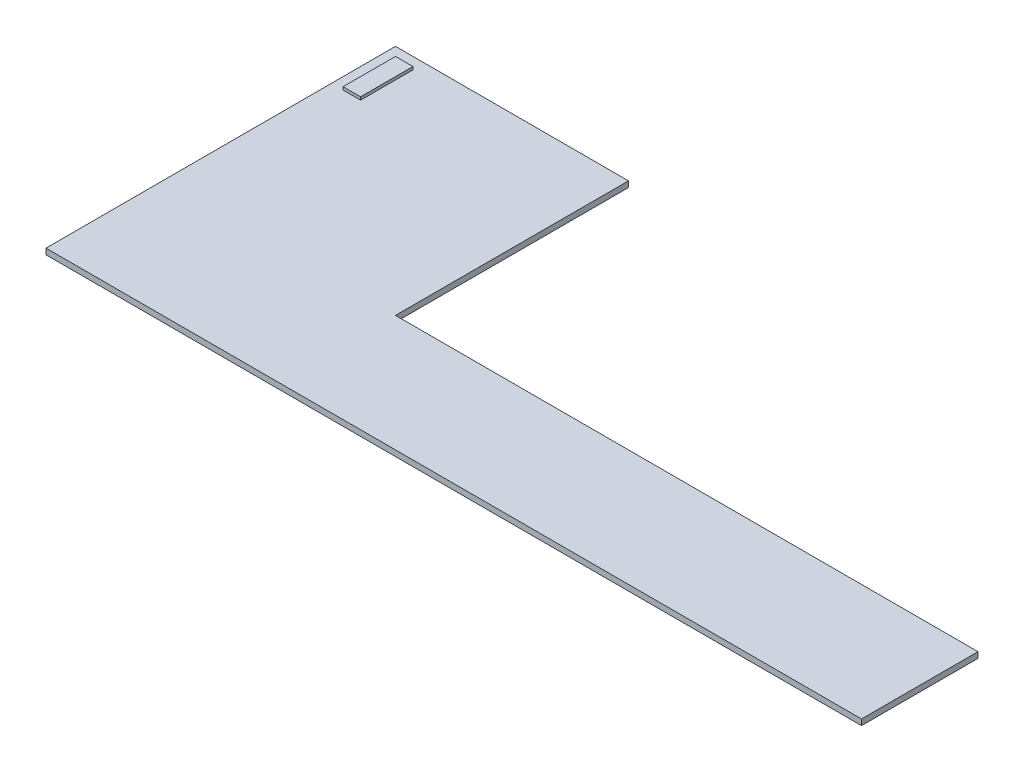
ISO-10303-21;
HEADER;
FILE_DESCRIPTION(('STEP AP214'),'2;1');
FILE_NAME('part.step','',(''),(''),'','','');
FILE_SCHEMA(('AUTOMOTIVE_DESIGN { 1 0 10303 214 1 1 1 1 }'));
ENDSEC;
DATA;
#1=APPLICATION_CONTEXT('core data for automotive mechanical design processes');
#2=APPLICATION_PROTOCOL_DEFINITION('international standard','automotive_design',2000,#1);
#3=PRODUCT_CONTEXT('',#1,'mechanical');
#4=PRODUCT('Part','Part','',(#3));
#5=PRODUCT_RELATED_PRODUCT_CATEGORY('part','',(#4));
#6=PRODUCT_DEFINITION_FORMATION('','',#4);
#7=PRODUCT_DEFINITION_CONTEXT('part definition',#1,'design');
#8=PRODUCT_DEFINITION('design','',#6,#7);
#9=PRODUCT_DEFINITION_SHAPE('','',#8);
#10=(LENGTH_UNIT() NAMED_UNIT(*) SI_UNIT(.MILLI.,.METRE.));
#11=(NAMED_UNIT(*) PLANE_ANGLE_UNIT() SI_UNIT($,.RADIAN.));
#12=(NAMED_UNIT(*) SI_UNIT($,.STERADIAN.) SOLID_ANGLE_UNIT());
#13=UNCERTAINTY_MEASURE_WITH_UNIT(LENGTH_MEASURE(1.E-05),#10,'distance_accuracy_value','');
#14=(GEOMETRIC_REPRESENTATION_CONTEXT(3) GLOBAL_UNCERTAINTY_ASSIGNED_CONTEXT((#13)) GLOBAL_UNIT_ASSIGNED_CONTEXT((#10,
#11,#12)) REPRESENTATION_CONTEXT('',''));
#15=CARTESIAN_POINT('',(0.,0.,0.));
#16=DIRECTION('',(0.,0.,1.));
#17=DIRECTION('',(1.,0.,0.));
#18=AXIS2_PLACEMENT_3D('',#15,#16,#17);
#19=CARTESIAN_POINT('',(0.,2.54,0.));
#20=DIRECTION('',(0.,0.,1.));
#21=DIRECTION('',(1.,0.,0.));
#22=AXIS2_PLACEMENT_3D('',#19,#20,#21);
#23=PLANE('',#22);
#24=DIRECTION('',(-1.,0.,0.));
#25=VECTOR('',#24,1.);
#26=CARTESIAN_POINT('',(0.,0.,0.));
#27=LINE('',#26,#25);
#28=CARTESIAN_POINT('',(254.,0.,0.));
#29=VERTEX_POINT('',#28);
#30=CARTESIAN_POINT('',(0.,0.,0.));
#31=VERTEX_POINT('',#30);
#32=EDGE_CURVE('E118',#29,#31,#27,.T.);
#33=ORIENTED_EDGE('',*,*,#32,.T.);
#34=DIRECTION('',(0.,-1.,0.));
#35=VECTOR('',#34,1.);
#36=CARTESIAN_POINT('',(0.,2.54,0.));
#37=LINE('',#36,#35);
#38=CARTESIAN_POINT('',(0.,2.54,0.));
#39=VERTEX_POINT('',#38);
#40=EDGE_CURVE('E11',#39,#31,#37,.T.);
#41=ORIENTED_EDGE('',*,*,#40,.F.);
#42=DIRECTION('',(-1.,0.,0.));
#43=VECTOR('',#42,1.);
#44=CARTESIAN_POINT('',(0.,2.54,0.));
#45=LINE('',#44,#43);
#46=CARTESIAN_POINT('',(254.,2.54,0.));
#47=VERTEX_POINT('',#46);
#48=EDGE_CURVE('E148',#47,#39,#45,.T.);
#49=ORIENTED_EDGE('',*,*,#48,.F.);
#50=DIRECTION('',(0.,-1.,0.));
#51=VECTOR('',#50,1.);
#52=CARTESIAN_POINT('',(254.,2.54,0.));
#53=LINE('',#52,#51);
#54=EDGE_CURVE('E162',#47,#29,#53,.T.);
#55=ORIENTED_EDGE('',*,*,#54,.T.);
#56=EDGE_LOOP('',(#33,#41,#49,#55));
#57=FACE_BOUND('',#56,.T.);
#58=ADVANCED_FACE('F35',(#57),#23,.F.);
#59=CARTESIAN_POINT('',(0.,2.54,0.));
#60=DIRECTION('',(-1.,0.,0.));
#61=DIRECTION('',(0.,0.,1.));
#62=AXIS2_PLACEMENT_3D('',#59,#60,#61);
#63=PLANE('',#62);
#64=DIRECTION('',(0.,0.,-1.));
#65=VECTOR('',#64,1.);
#66=CARTESIAN_POINT('',(0.,0.,0.));
#67=LINE('',#66,#65);
#68=CARTESIAN_POINT('',(0.,0.,-101.6));
#69=VERTEX_POINT('',#68);
#70=EDGE_CURVE('E165',#31,#69,#67,.T.);
#71=ORIENTED_EDGE('',*,*,#70,.T.);
#72=DIRECTION('',(0.,-1.,0.));
#73=VECTOR('',#72,1.);
#74=CARTESIAN_POINT('',(0.,2.54,-101.6));
#75=LINE('',#74,#73);
#76=CARTESIAN_POINT('',(0.,2.54,-101.6));
#77=VERTEX_POINT('',#76);
#78=EDGE_CURVE('E42',#77,#69,#75,.T.);
#79=ORIENTED_EDGE('',*,*,#78,.F.);
#80=DIRECTION('',(0.,0.,-1.));
#81=VECTOR('',#80,1.);
#82=CARTESIAN_POINT('',(0.,2.54,0.));
#83=LINE('',#82,#81);
#84=EDGE_CURVE('E151',#39,#77,#83,.T.);
#85=ORIENTED_EDGE('',*,*,#84,.F.);
#86=ORIENTED_EDGE('',*,*,#40,.T.);
#87=EDGE_LOOP('',(#71,#79,#85,#86));
#88=FACE_BOUND('',#87,.T.);
#89=ADVANCED_FACE('F212',(#88),#63,.F.);
#90=CARTESIAN_POINT('',(-101.6,2.54,-101.6));
#91=DIRECTION('',(0.,0.,1.));
#92=DIRECTION('',(1.,0.,0.));
#93=AXIS2_PLACEMENT_3D('',#90,#91,#92);
#94=PLANE('',#93);
#95=DIRECTION('',(-1.,0.,0.));
#96=VECTOR('',#95,1.);
#97=CARTESIAN_POINT('',(-101.6,0.,-101.6));
#98=LINE('',#97,#96);
#99=CARTESIAN_POINT('',(-101.6,0.,-101.6));
#100=VERTEX_POINT('',#99);
#101=EDGE_CURVE('E167',#69,#100,#98,.T.);
#102=ORIENTED_EDGE('',*,*,#101,.T.);
#103=DIRECTION('',(0.,-1.,0.));
#104=VECTOR('',#103,1.);
#105=CARTESIAN_POINT('',(-101.6,2.54,-101.6));
#106=LINE('',#105,#104);
#107=CARTESIAN_POINT('',(-101.6,2.54,-101.6));
#108=VERTEX_POINT('',#107);
#109=EDGE_CURVE('E182',#108,#100,#106,.T.);
#110=ORIENTED_EDGE('',*,*,#109,.F.);
#111=DIRECTION('',(-1.,0.,0.));
#112=VECTOR('',#111,1.);
#113=CARTESIAN_POINT('',(-101.6,2.54,-101.6));
#114=LINE('',#113,#112);
#115=EDGE_CURVE('E154',#77,#108,#114,.T.);
#116=ORIENTED_EDGE('',*,*,#115,.F.);
#117=ORIENTED_EDGE('',*,*,#78,.T.);
#118=EDGE_LOOP('',(#102,#110,#116,#117));
#119=FACE_BOUND('',#118,.T.);
#120=ADVANCED_FACE('F189',(#119),#94,.F.);
#121=CARTESIAN_POINT('',(-101.6,2.54,50.8));
#122=DIRECTION('',(1.,0.,0.));
#123=DIRECTION('',(0.,0.,-1.));
#124=AXIS2_PLACEMENT_3D('',#121,#122,#123);
#125=PLANE('',#124);
#126=DIRECTION('',(0.,0.,1.));
#127=VECTOR('',#126,1.);
#128=CARTESIAN_POINT('',(-101.6,0.,50.8));
#129=LINE('',#128,#127);
#130=CARTESIAN_POINT('',(-101.6,0.,50.8));
#131=VERTEX_POINT('',#130);
#132=EDGE_CURVE('E169',#100,#131,#129,.T.);
#133=ORIENTED_EDGE('',*,*,#132,.T.);
#134=DIRECTION('',(0.,-1.,0.));
#135=VECTOR('',#134,1.);
#136=CARTESIAN_POINT('',(-101.6,2.54,50.8));
#137=LINE('',#136,#135);
#138=CARTESIAN_POINT('',(-101.6,2.54,50.8));
#139=VERTEX_POINT('',#138);
#140=EDGE_CURVE('E179',#139,#131,#137,.T.);
#141=ORIENTED_EDGE('',*,*,#140,.F.);
#142=DIRECTION('',(0.,0.,1.));
#143=VECTOR('',#142,1.);
#144=CARTESIAN_POINT('',(-101.6,2.54,50.8));
#145=LINE('',#144,#143);
#146=EDGE_CURVE('E156',#108,#139,#145,.T.);
#147=ORIENTED_EDGE('',*,*,#146,.F.);
#148=ORIENTED_EDGE('',*,*,#109,.T.);
#149=EDGE_LOOP('',(#133,#141,#147,#148));
#150=FACE_BOUND('',#149,.T.);
#151=ADVANCED_FACE('F200',(#150),#125,.F.);
#152=CARTESIAN_POINT('',(254.,2.54,50.8));
#153=DIRECTION('',(0.,0.,-1.));
#154=DIRECTION('',(-1.,0.,0.));
#155=AXIS2_PLACEMENT_3D('',#152,#153,#154);
#156=PLANE('',#155);
#157=DIRECTION('',(1.,0.,0.));
#158=VECTOR('',#157,1.);
#159=CARTESIAN_POINT('',(254.,0.,50.8));
#160=LINE('',#159,#158);
#161=CARTESIAN_POINT('',(254.,0.,50.8));
#162=VERTEX_POINT('',#161);
#163=EDGE_CURVE('E171',#131,#162,#160,.T.);
#164=ORIENTED_EDGE('',*,*,#163,.T.);
#165=DIRECTION('',(0.,-1.,0.));
#166=VECTOR('',#165,1.);
#167=CARTESIAN_POINT('',(254.,2.54,50.8));
#168=LINE('',#167,#166);
#169=CARTESIAN_POINT('',(254.,2.54,50.8));
#170=VERTEX_POINT('',#169);
#171=EDGE_CURVE('E176',#170,#162,#168,.T.);
#172=ORIENTED_EDGE('',*,*,#171,.F.);
#173=DIRECTION('',(1.,0.,0.));
#174=VECTOR('',#173,1.);
#175=CARTESIAN_POINT('',(254.,2.54,50.8));
#176=LINE('',#175,#174);
#177=EDGE_CURVE('E158',#139,#170,#176,.T.);
#178=ORIENTED_EDGE('',*,*,#177,.F.);
#179=ORIENTED_EDGE('',*,*,#140,.T.);
#180=EDGE_LOOP('',(#164,#172,#178,#179));
#181=FACE_BOUND('',#180,.T.);
#182=ADVANCED_FACE('F204',(#181),#156,.F.);
#183=CARTESIAN_POINT('',(254.,2.54,0.));
#184=DIRECTION('',(-1.,0.,0.));
#185=DIRECTION('',(0.,0.,1.));
#186=AXIS2_PLACEMENT_3D('',#183,#184,#185);
#187=PLANE('',#186);
#188=DIRECTION('',(0.,0.,-1.));
#189=VECTOR('',#188,1.);
#190=CARTESIAN_POINT('',(254.,0.,0.));
#191=LINE('',#190,#189);
#192=EDGE_CURVE('E152',#162,#29,#191,.T.);
#193=ORIENTED_EDGE('',*,*,#192,.T.);
#194=ORIENTED_EDGE('',*,*,#54,.F.);
#195=DIRECTION('',(0.,0.,-1.));
#196=VECTOR('',#195,1.);
#197=CARTESIAN_POINT('',(254.,2.54,0.));
#198=LINE('',#197,#196);
#199=EDGE_CURVE('E160',#170,#47,#198,.T.);
#200=ORIENTED_EDGE('',*,*,#199,.F.);
#201=ORIENTED_EDGE('',*,*,#171,.T.);
#202=EDGE_LOOP('',(#193,#194,#200,#201));
#203=FACE_BOUND('',#202,.T.);
#204=ADVANCED_FACE('F215',(#203),#187,.F.);
#205=CARTESIAN_POINT('',(0.,2.54,0.));
#206=DIRECTION('',(0.,-1.,0.));
#207=DIRECTION('',(0.,0.,-1.));
#208=AXIS2_PLACEMENT_3D('',#205,#206,#207);
#209=PLANE('',#208);
#210=DIRECTION('',(1.,0.,0.));
#211=VECTOR('',#210,1.);
#212=CARTESIAN_POINT('',(0.,2.54,-96.5199999999999));
#213=LINE('',#212,#211);
#214=CARTESIAN_POINT('',(-96.52,2.54,-96.5199999999999));
#215=VERTEX_POINT('',#214);
#216=CARTESIAN_POINT('',(-88.8999999999999,2.54,-96.5199999999999));
#217=VERTEX_POINT('',#216);
#218=EDGE_CURVE('E49',#215,#217,#213,.T.);
#219=ORIENTED_EDGE('',*,*,#218,.T.);
#220=DIRECTION('',(0.,0.,1.));
#221=VECTOR('',#220,1.);
#222=CARTESIAN_POINT('',(-88.8999999999999,2.54,0.));
#223=LINE('',#222,#221);
#224=CARTESIAN_POINT('',(-88.9,2.54,-73.6599999999999));
#225=VERTEX_POINT('',#224);
#226=EDGE_CURVE('E115',#217,#225,#223,.T.);
#227=ORIENTED_EDGE('',*,*,#226,.T.);
#228=DIRECTION('',(1.,0.,0.));
#229=VECTOR('',#228,1.);
#230=CARTESIAN_POINT('',(-1.34151948808873E-13,2.54,-73.6600000000001));
#231=LINE('',#230,#229);
#232=CARTESIAN_POINT('',(-96.52,2.54,-73.6599999999999));
#233=VERTEX_POINT('',#232);
#234=EDGE_CURVE('E128',#233,#225,#231,.T.);
#235=ORIENTED_EDGE('',*,*,#234,.F.);
#236=DIRECTION('',(0.,0.,1.));
#237=VECTOR('',#236,1.);
#238=CARTESIAN_POINT('',(-96.5200000000002,2.54,-1.75785312232317E-13));
#239=LINE('',#238,#237);
#240=EDGE_CURVE('E54',#215,#233,#239,.T.);
#241=ORIENTED_EDGE('',*,*,#240,.F.);
#242=EDGE_LOOP('',(#219,#227,#235,#241));
#243=FACE_BOUND('',#242,.T.);
#244=ORIENTED_EDGE('',*,*,#48,.T.);
#245=ORIENTED_EDGE('',*,*,#84,.T.);
#246=ORIENTED_EDGE('',*,*,#115,.T.);
#247=ORIENTED_EDGE('',*,*,#146,.T.);
#248=ORIENTED_EDGE('',*,*,#177,.T.);
#249=ORIENTED_EDGE('',*,*,#199,.T.);
#250=EDGE_LOOP('',(#244,#245,#246,#247,#248,#249));
#251=FACE_BOUND('',#250,.T.);
#252=ADVANCED_FACE('F208',(#243,#251),#209,.F.);
#253=CARTESIAN_POINT('',(0.,0.,0.));
#254=DIRECTION('',(0.,-1.,0.));
#255=DIRECTION('',(0.,0.,-1.));
#256=AXIS2_PLACEMENT_3D('',#253,#254,#255);
#257=PLANE('',#256);
#258=ORIENTED_EDGE('',*,*,#32,.F.);
#259=ORIENTED_EDGE('',*,*,#192,.F.);
#260=ORIENTED_EDGE('',*,*,#163,.F.);
#261=ORIENTED_EDGE('',*,*,#132,.F.);
#262=ORIENTED_EDGE('',*,*,#101,.F.);
#263=ORIENTED_EDGE('',*,*,#70,.F.);
#264=EDGE_LOOP('',(#258,#259,#260,#261,#262,#263));
#265=FACE_BOUND('',#264,.T.);
#266=ADVANCED_FACE('F195',(#265),#257,.T.);
#267=CARTESIAN_POINT('',(-88.8999999999999,3.81,0.));
#268=DIRECTION('',(1.,0.,0.));
#269=DIRECTION('',(0.,0.,-1.));
#270=AXIS2_PLACEMENT_3D('',#267,#268,#269);
#271=PLANE('',#270);
#272=ORIENTED_EDGE('',*,*,#226,.F.);
#273=DIRECTION('',(0.,-1.,0.));
#274=VECTOR('',#273,1.);
#275=CARTESIAN_POINT('',(-88.8999999999999,3.81,-96.5199999999999));
#276=LINE('',#275,#274);
#277=CARTESIAN_POINT('',(-88.8999999999999,3.81,-96.5199999999999));
#278=VERTEX_POINT('',#277);
#279=EDGE_CURVE('E110',#278,#217,#276,.T.);
#280=ORIENTED_EDGE('',*,*,#279,.F.);
#281=DIRECTION('',(0.,0.,1.));
#282=VECTOR('',#281,1.);
#283=CARTESIAN_POINT('',(-88.8999999999999,3.81,0.));
#284=LINE('',#283,#282);
#285=CARTESIAN_POINT('',(-88.9,3.81,-73.6599999999999));
#286=VERTEX_POINT('',#285);
#287=EDGE_CURVE('E114',#278,#286,#284,.T.);
#288=ORIENTED_EDGE('',*,*,#287,.T.);
#289=DIRECTION('',(0.,-1.,0.));
#290=VECTOR('',#289,1.);
#291=CARTESIAN_POINT('',(-88.9,3.81,-73.6599999999999));
#292=LINE('',#291,#290);
#293=EDGE_CURVE('E137',#286,#225,#292,.T.);
#294=ORIENTED_EDGE('',*,*,#293,.T.);
#295=EDGE_LOOP('',(#272,#280,#288,#294));
#296=FACE_BOUND('',#295,.T.);
#297=ADVANCED_FACE('F112',(#296),#271,.T.);
#298=CARTESIAN_POINT('',(0.,3.81,-96.5199999999999));
#299=DIRECTION('',(0.,0.,-1.));
#300=DIRECTION('',(-1.,0.,0.));
#301=AXIS2_PLACEMENT_3D('',#298,#299,#300);
#302=PLANE('',#301);
#303=ORIENTED_EDGE('',*,*,#218,.F.);
#304=DIRECTION('',(0.,-1.,0.));
#305=VECTOR('',#304,1.);
#306=CARTESIAN_POINT('',(-96.52,3.81,-96.5199999999999));
#307=LINE('',#306,#305);
#308=CARTESIAN_POINT('',(-96.52,3.81,-96.5199999999999));
#309=VERTEX_POINT('',#308);
#310=EDGE_CURVE('E119',#309,#215,#307,.T.);
#311=ORIENTED_EDGE('',*,*,#310,.F.);
#312=DIRECTION('',(1.,0.,0.));
#313=VECTOR('',#312,1.);
#314=CARTESIAN_POINT('',(0.,3.81,-96.5199999999999));
#315=LINE('',#314,#313);
#316=EDGE_CURVE('E124',#309,#278,#315,.T.);
#317=ORIENTED_EDGE('',*,*,#316,.T.);
#318=ORIENTED_EDGE('',*,*,#279,.T.);
#319=EDGE_LOOP('',(#303,#311,#317,#318));
#320=FACE_BOUND('',#319,.T.);
#321=ADVANCED_FACE('F130',(#320),#302,.T.);
#322=CARTESIAN_POINT('',(-96.5200000000002,3.81,-1.75785312232317E-13));
#323=DIRECTION('',(1.,0.,0.));
#324=DIRECTION('',(0.,0.,-1.));
#325=AXIS2_PLACEMENT_3D('',#322,#323,#324);
#326=PLANE('',#325);
#327=ORIENTED_EDGE('',*,*,#240,.T.);
#328=DIRECTION('',(0.,-1.,0.));
#329=VECTOR('',#328,1.);
#330=CARTESIAN_POINT('',(-96.52,3.81,-73.6599999999999));
#331=LINE('',#330,#329);
#332=CARTESIAN_POINT('',(-96.52,3.81,-73.6599999999999));
#333=VERTEX_POINT('',#332);
#334=EDGE_CURVE('E144',#333,#233,#331,.T.);
#335=ORIENTED_EDGE('',*,*,#334,.F.);
#336=DIRECTION('',(0.,0.,1.));
#337=VECTOR('',#336,1.);
#338=CARTESIAN_POINT('',(-96.5200000000002,3.81,-1.75785312232317E-13));
#339=LINE('',#338,#337);
#340=EDGE_CURVE('E132',#309,#333,#339,.T.);
#341=ORIENTED_EDGE('',*,*,#340,.F.);
#342=ORIENTED_EDGE('',*,*,#310,.T.);
#343=EDGE_LOOP('',(#327,#335,#341,#342));
#344=FACE_BOUND('',#343,.T.);
#345=ADVANCED_FACE('F278',(#344),#326,.F.);
#346=CARTESIAN_POINT('',(-1.34151948808873E-13,3.81,-73.6600000000001));
#347=DIRECTION('',(0.,0.,-1.));
#348=DIRECTION('',(-1.,0.,0.));
#349=AXIS2_PLACEMENT_3D('',#346,#347,#348);
#350=PLANE('',#349);
#351=ORIENTED_EDGE('',*,*,#234,.T.);
#352=ORIENTED_EDGE('',*,*,#293,.F.);
#353=DIRECTION('',(1.,0.,0.));
#354=VECTOR('',#353,1.);
#355=CARTESIAN_POINT('',(-1.34151948808873E-13,3.81,-73.6600000000001));
#356=LINE('',#355,#354);
#357=EDGE_CURVE('E126',#333,#286,#356,.T.);
#358=ORIENTED_EDGE('',*,*,#357,.F.);
#359=ORIENTED_EDGE('',*,*,#334,.T.);
#360=EDGE_LOOP('',(#351,#352,#358,#359));
#361=FACE_BOUND('',#360,.T.);
#362=ADVANCED_FACE('F289',(#361),#350,.F.);
#363=CARTESIAN_POINT('',(0.,3.81,0.));
#364=DIRECTION('',(0.,1.,0.));
#365=DIRECTION('',(0.,0.,1.));
#366=AXIS2_PLACEMENT_3D('',#363,#364,#365);
#367=PLANE('',#366);
#368=ORIENTED_EDGE('',*,*,#287,.F.);
#369=ORIENTED_EDGE('',*,*,#316,.F.);
#370=ORIENTED_EDGE('',*,*,#340,.T.);
#371=ORIENTED_EDGE('',*,*,#357,.T.);
#372=EDGE_LOOP('',(#368,#369,#370,#371));
#373=FACE_BOUND('',#372,.T.);
#374=ADVANCED_FACE('F123',(#373),#367,.T.);
#375=CLOSED_SHELL('',(#58,#89,#120,#151,#182,#204,#252,#266,#297,#321,#345,#362,#374));
#376=MANIFOLD_SOLID_BREP('B2',#375);
#377=ADVANCED_BREP_SHAPE_REPRESENTATION('',(#18,#376),#14);
#378=SHAPE_DEFINITION_REPRESENTATION(#9,#377);
ENDSEC;
END-ISO-10303-21;
